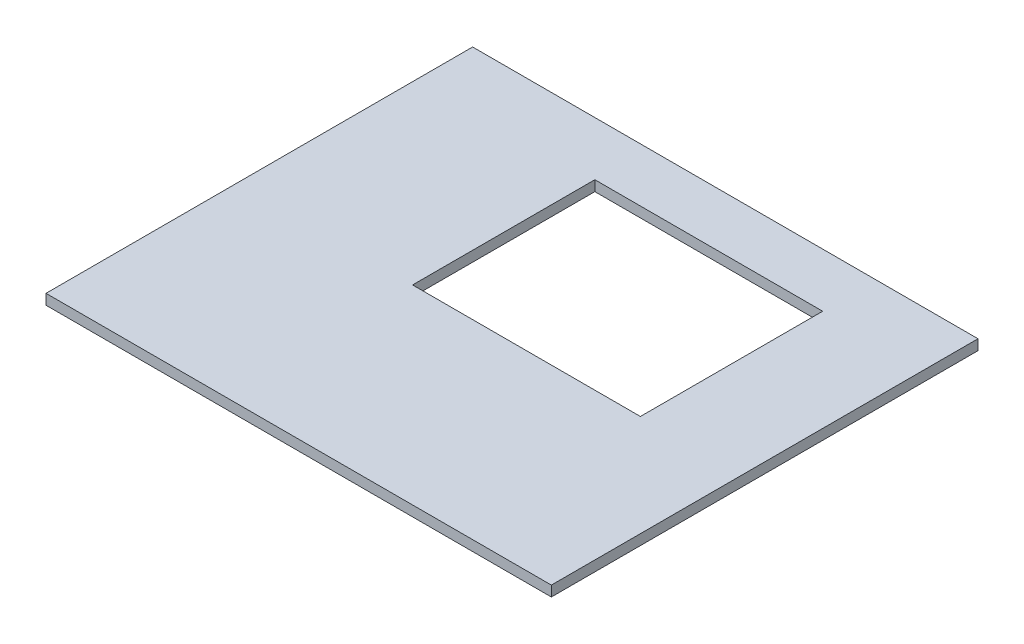
ISO-10303-21;
HEADER;
FILE_DESCRIPTION(('STEP AP214'),'2;1');
FILE_NAME('part.step','',(''),(''),'','','');
FILE_SCHEMA(('AUTOMOTIVE_DESIGN { 1 0 10303 214 1 1 1 1 }'));
ENDSEC;
DATA;
#1=APPLICATION_CONTEXT('core data for automotive mechanical design processes');
#2=APPLICATION_PROTOCOL_DEFINITION('international standard','automotive_design',2000,#1);
#3=PRODUCT_CONTEXT('',#1,'mechanical');
#4=PRODUCT('Part','Part','',(#3));
#5=PRODUCT_RELATED_PRODUCT_CATEGORY('part','',(#4));
#6=PRODUCT_DEFINITION_FORMATION('','',#4);
#7=PRODUCT_DEFINITION_CONTEXT('part definition',#1,'design');
#8=PRODUCT_DEFINITION('design','',#6,#7);
#9=PRODUCT_DEFINITION_SHAPE('','',#8);
#10=(LENGTH_UNIT() NAMED_UNIT(*) SI_UNIT(.MILLI.,.METRE.));
#11=(NAMED_UNIT(*) PLANE_ANGLE_UNIT() SI_UNIT($,.RADIAN.));
#12=(NAMED_UNIT(*) SI_UNIT($,.STERADIAN.) SOLID_ANGLE_UNIT());
#13=UNCERTAINTY_MEASURE_WITH_UNIT(LENGTH_MEASURE(1.E-05),#10,'distance_accuracy_value','');
#14=(GEOMETRIC_REPRESENTATION_CONTEXT(3) GLOBAL_UNCERTAINTY_ASSIGNED_CONTEXT((#13)) GLOBAL_UNIT_ASSIGNED_CONTEXT((#10,
#11,#12)) REPRESENTATION_CONTEXT('',''));
#15=CARTESIAN_POINT('',(0.,0.,0.));
#16=DIRECTION('',(0.,0.,1.));
#17=DIRECTION('',(1.,0.,0.));
#18=AXIS2_PLACEMENT_3D('',#15,#16,#17);
#19=CARTESIAN_POINT('',(-59.5,2.5,-51.5));
#20=DIRECTION('',(0.,0.,1.));
#21=DIRECTION('',(1.,0.,0.));
#22=AXIS2_PLACEMENT_3D('',#19,#20,#21);
#23=PLANE('',#22);
#24=DIRECTION('',(-1.,0.,0.));
#25=VECTOR('',#24,1.);
#26=CARTESIAN_POINT('',(-59.5,0.,-51.5));
#27=LINE('',#26,#25);
#28=CARTESIAN_POINT('',(61.,0.,-51.5));
#29=VERTEX_POINT('',#28);
#30=CARTESIAN_POINT('',(-61.,0.,-51.5));
#31=VERTEX_POINT('',#30);
#32=EDGE_CURVE('E110',#29,#31,#27,.T.);
#33=ORIENTED_EDGE('',*,*,#32,.T.);
#34=DIRECTION('',(0.,-1.,0.));
#35=VECTOR('',#34,1.);
#36=CARTESIAN_POINT('',(-61.,2.5,-51.5));
#37=LINE('',#36,#35);
#38=CARTESIAN_POINT('',(-61.,2.5,-51.5));
#39=VERTEX_POINT('',#38);
#40=EDGE_CURVE('E128',#39,#31,#37,.T.);
#41=ORIENTED_EDGE('',*,*,#40,.F.);
#42=DIRECTION('',(-1.,0.,0.));
#43=VECTOR('',#42,1.);
#44=CARTESIAN_POINT('',(-59.5,2.5,-51.5));
#45=LINE('',#44,#43);
#46=CARTESIAN_POINT('',(61.,2.5,-51.5));
#47=VERTEX_POINT('',#46);
#48=EDGE_CURVE('E109',#47,#39,#45,.T.);
#49=ORIENTED_EDGE('',*,*,#48,.F.);
#50=DIRECTION('',(0.,1.,0.));
#51=VECTOR('',#50,1.);
#52=CARTESIAN_POINT('',(61.,0.,-51.5));
#53=LINE('',#52,#51);
#54=EDGE_CURVE('E118',#29,#47,#53,.T.);
#55=ORIENTED_EDGE('',*,*,#54,.F.);
#56=EDGE_LOOP('',(#33,#41,#49,#55));
#57=FACE_BOUND('',#56,.T.);
#58=ADVANCED_FACE('F35',(#57),#23,.F.);
#59=CARTESIAN_POINT('',(-59.5,2.5,51.5));
#60=DIRECTION('',(0.,0.,-1.));
#61=DIRECTION('',(-1.,0.,0.));
#62=AXIS2_PLACEMENT_3D('',#59,#60,#61);
#63=PLANE('',#62);
#64=DIRECTION('',(1.,0.,0.));
#65=VECTOR('',#64,1.);
#66=CARTESIAN_POINT('',(-59.5,0.,51.5));
#67=LINE('',#66,#65);
#68=CARTESIAN_POINT('',(-61.,0.,51.5));
#69=VERTEX_POINT('',#68);
#70=CARTESIAN_POINT('',(61.,0.,51.5));
#71=VERTEX_POINT('',#70);
#72=EDGE_CURVE('E99',#69,#71,#67,.T.);
#73=ORIENTED_EDGE('',*,*,#72,.T.);
#74=DIRECTION('',(0.,-1.,0.));
#75=VECTOR('',#74,1.);
#76=CARTESIAN_POINT('',(61.,2.5,51.5));
#77=LINE('',#76,#75);
#78=CARTESIAN_POINT('',(61.,2.5,51.5));
#79=VERTEX_POINT('',#78);
#80=EDGE_CURVE('E103',#79,#71,#77,.T.);
#81=ORIENTED_EDGE('',*,*,#80,.F.);
#82=DIRECTION('',(1.,0.,0.));
#83=VECTOR('',#82,1.);
#84=CARTESIAN_POINT('',(-59.5,2.5,51.5));
#85=LINE('',#84,#83);
#86=CARTESIAN_POINT('',(-61.,2.5,51.5));
#87=VERTEX_POINT('',#86);
#88=EDGE_CURVE('E154',#87,#79,#85,.T.);
#89=ORIENTED_EDGE('',*,*,#88,.F.);
#90=DIRECTION('',(0.,1.,0.));
#91=VECTOR('',#90,1.);
#92=CARTESIAN_POINT('',(-61.,0.,51.5));
#93=LINE('',#92,#91);
#94=EDGE_CURVE('E105',#69,#87,#93,.T.);
#95=ORIENTED_EDGE('',*,*,#94,.F.);
#96=EDGE_LOOP('',(#73,#81,#89,#95));
#97=FACE_BOUND('',#96,.T.);
#98=ADVANCED_FACE('F101',(#97),#63,.F.);
#99=CARTESIAN_POINT('',(0.,2.5,0.));
#100=DIRECTION('',(0.,-1.,0.));
#101=DIRECTION('',(0.,0.,-1.));
#102=AXIS2_PLACEMENT_3D('',#99,#100,#101);
#103=PLANE('',#102);
#104=DIRECTION('',(-1.,0.,0.));
#105=VECTOR('',#104,1.);
#106=CARTESIAN_POINT('',(-18.5,2.5,-38.5));
#107=LINE('',#106,#105);
#108=CARTESIAN_POINT('',(36.5,2.5,-38.5));
#109=VERTEX_POINT('',#108);
#110=CARTESIAN_POINT('',(-18.5,2.5,-38.5));
#111=VERTEX_POINT('',#110);
#112=EDGE_CURVE('E138',#109,#111,#107,.T.);
#113=ORIENTED_EDGE('',*,*,#112,.F.);
#114=DIRECTION('',(0.,0.,-1.));
#115=VECTOR('',#114,1.);
#116=CARTESIAN_POINT('',(36.5,2.5,5.50000000000001));
#117=LINE('',#116,#115);
#118=CARTESIAN_POINT('',(36.5,2.5,5.50000000000001));
#119=VERTEX_POINT('',#118);
#120=EDGE_CURVE('E49',#119,#109,#117,.T.);
#121=ORIENTED_EDGE('',*,*,#120,.F.);
#122=DIRECTION('',(1.,0.,0.));
#123=VECTOR('',#122,1.);
#124=CARTESIAN_POINT('',(-18.5,2.5,5.50000000000001));
#125=LINE('',#124,#123);
#126=CARTESIAN_POINT('',(-18.5,2.5,5.50000000000001));
#127=VERTEX_POINT('',#126);
#128=EDGE_CURVE('E143',#127,#119,#125,.T.);
#129=ORIENTED_EDGE('',*,*,#128,.F.);
#130=DIRECTION('',(0.,0.,1.));
#131=VECTOR('',#130,1.);
#132=CARTESIAN_POINT('',(-18.5,2.5,5.50000000000001));
#133=LINE('',#132,#131);
#134=EDGE_CURVE('E140',#111,#127,#133,.T.);
#135=ORIENTED_EDGE('',*,*,#134,.F.);
#136=EDGE_LOOP('',(#113,#121,#129,#135));
#137=FACE_BOUND('',#136,.T.);
#138=ORIENTED_EDGE('',*,*,#88,.T.);
#139=DIRECTION('',(0.,0.,1.));
#140=VECTOR('',#139,1.);
#141=CARTESIAN_POINT('',(61.,2.5,-51.5));
#142=LINE('',#141,#140);
#143=EDGE_CURVE('E123',#47,#79,#142,.T.);
#144=ORIENTED_EDGE('',*,*,#143,.F.);
#145=ORIENTED_EDGE('',*,*,#48,.T.);
#146=DIRECTION('',(0.,0.,-1.));
#147=VECTOR('',#146,1.);
#148=CARTESIAN_POINT('',(-61.,2.5,51.5));
#149=LINE('',#148,#147);
#150=EDGE_CURVE('E134',#87,#39,#149,.T.);
#151=ORIENTED_EDGE('',*,*,#150,.F.);
#152=EDGE_LOOP('',(#138,#144,#145,#151));
#153=FACE_BOUND('',#152,.T.);
#154=ADVANCED_FACE('F177',(#137,#153),#103,.F.);
#155=CARTESIAN_POINT('',(0.,0.,0.));
#156=DIRECTION('',(0.,-1.,0.));
#157=DIRECTION('',(0.,0.,-1.));
#158=AXIS2_PLACEMENT_3D('',#155,#156,#157);
#159=PLANE('',#158);
#160=DIRECTION('',(0.,0.,1.));
#161=VECTOR('',#160,1.);
#162=CARTESIAN_POINT('',(36.5,0.,0.));
#163=LINE('',#162,#161);
#164=CARTESIAN_POINT('',(36.5,0.,-38.5));
#165=VERTEX_POINT('',#164);
#166=CARTESIAN_POINT('',(36.5,0.,5.50000000000001));
#167=VERTEX_POINT('',#166);
#168=EDGE_CURVE('E11',#165,#167,#163,.T.);
#169=ORIENTED_EDGE('',*,*,#168,.F.);
#170=DIRECTION('',(1.,0.,0.));
#171=VECTOR('',#170,1.);
#172=CARTESIAN_POINT('',(0.,0.,-38.5));
#173=LINE('',#172,#171);
#174=CARTESIAN_POINT('',(-18.5,0.,-38.5));
#175=VERTEX_POINT('',#174);
#176=EDGE_CURVE('E156',#175,#165,#173,.T.);
#177=ORIENTED_EDGE('',*,*,#176,.F.);
#178=DIRECTION('',(0.,0.,-1.));
#179=VECTOR('',#178,1.);
#180=CARTESIAN_POINT('',(-18.5,0.,0.));
#181=LINE('',#180,#179);
#182=CARTESIAN_POINT('',(-18.5,0.,5.50000000000001));
#183=VERTEX_POINT('',#182);
#184=EDGE_CURVE('E159',#183,#175,#181,.T.);
#185=ORIENTED_EDGE('',*,*,#184,.F.);
#186=DIRECTION('',(-1.,0.,0.));
#187=VECTOR('',#186,1.);
#188=CARTESIAN_POINT('',(0.,0.,5.50000000000001));
#189=LINE('',#188,#187);
#190=EDGE_CURVE('E42',#167,#183,#189,.T.);
#191=ORIENTED_EDGE('',*,*,#190,.F.);
#192=EDGE_LOOP('',(#169,#177,#185,#191));
#193=FACE_BOUND('',#192,.T.);
#194=ORIENTED_EDGE('',*,*,#32,.F.);
#195=DIRECTION('',(0.,0.,-1.));
#196=VECTOR('',#195,1.);
#197=CARTESIAN_POINT('',(61.,0.,51.5));
#198=LINE('',#197,#196);
#199=EDGE_CURVE('E113',#71,#29,#198,.T.);
#200=ORIENTED_EDGE('',*,*,#199,.F.);
#201=ORIENTED_EDGE('',*,*,#72,.F.);
#202=DIRECTION('',(0.,0.,1.));
#203=VECTOR('',#202,1.);
#204=CARTESIAN_POINT('',(-61.,0.,-51.5));
#205=LINE('',#204,#203);
#206=EDGE_CURVE('E131',#31,#69,#205,.T.);
#207=ORIENTED_EDGE('',*,*,#206,.F.);
#208=EDGE_LOOP('',(#194,#200,#201,#207));
#209=FACE_BOUND('',#208,.T.);
#210=ADVANCED_FACE('F114',(#193,#209),#159,.T.);
#211=CARTESIAN_POINT('',(36.5,-7.5,5.50000000000001));
#212=DIRECTION('',(1.,0.,0.));
#213=DIRECTION('',(0.,0.,-1.));
#214=AXIS2_PLACEMENT_3D('',#211,#212,#213);
#215=PLANE('',#214);
#216=ORIENTED_EDGE('',*,*,#168,.T.);
#217=DIRECTION('',(0.,1.,0.));
#218=VECTOR('',#217,1.);
#219=CARTESIAN_POINT('',(36.5,-7.5,5.50000000000001));
#220=LINE('',#219,#218);
#221=EDGE_CURVE('E147',#167,#119,#220,.T.);
#222=ORIENTED_EDGE('',*,*,#221,.T.);
#223=ORIENTED_EDGE('',*,*,#120,.T.);
#224=DIRECTION('',(0.,1.,0.));
#225=VECTOR('',#224,1.);
#226=CARTESIAN_POINT('',(36.5,-7.5,-38.5));
#227=LINE('',#226,#225);
#228=EDGE_CURVE('E146',#165,#109,#227,.T.);
#229=ORIENTED_EDGE('',*,*,#228,.F.);
#230=EDGE_LOOP('',(#216,#222,#223,#229));
#231=FACE_BOUND('',#230,.T.);
#232=ADVANCED_FACE('F175',(#231),#215,.F.);
#233=CARTESIAN_POINT('',(-18.5,-7.5,5.50000000000001));
#234=DIRECTION('',(0.,0.,1.));
#235=DIRECTION('',(1.,0.,0.));
#236=AXIS2_PLACEMENT_3D('',#233,#234,#235);
#237=PLANE('',#236);
#238=ORIENTED_EDGE('',*,*,#190,.T.);
#239=DIRECTION('',(0.,1.,0.));
#240=VECTOR('',#239,1.);
#241=CARTESIAN_POINT('',(-18.5,-7.5,5.50000000000001));
#242=LINE('',#241,#240);
#243=EDGE_CURVE('E149',#183,#127,#242,.T.);
#244=ORIENTED_EDGE('',*,*,#243,.T.);
#245=ORIENTED_EDGE('',*,*,#128,.T.);
#246=ORIENTED_EDGE('',*,*,#221,.F.);
#247=EDGE_LOOP('',(#238,#244,#245,#246));
#248=FACE_BOUND('',#247,.T.);
#249=ADVANCED_FACE('F164',(#248),#237,.F.);
#250=CARTESIAN_POINT('',(-18.5,-7.5,5.50000000000001));
#251=DIRECTION('',(-1.,0.,0.));
#252=DIRECTION('',(0.,0.,1.));
#253=AXIS2_PLACEMENT_3D('',#250,#251,#252);
#254=PLANE('',#253);
#255=ORIENTED_EDGE('',*,*,#184,.T.);
#256=DIRECTION('',(0.,1.,0.));
#257=VECTOR('',#256,1.);
#258=CARTESIAN_POINT('',(-18.5,-7.5,-38.5));
#259=LINE('',#258,#257);
#260=EDGE_CURVE('E57',#175,#111,#259,.T.);
#261=ORIENTED_EDGE('',*,*,#260,.T.);
#262=ORIENTED_EDGE('',*,*,#134,.T.);
#263=ORIENTED_EDGE('',*,*,#243,.F.);
#264=EDGE_LOOP('',(#255,#261,#262,#263));
#265=FACE_BOUND('',#264,.T.);
#266=ADVANCED_FACE('F169',(#265),#254,.F.);
#267=CARTESIAN_POINT('',(-18.5,-7.5,-38.5));
#268=DIRECTION('',(0.,0.,-1.));
#269=DIRECTION('',(-1.,0.,0.));
#270=AXIS2_PLACEMENT_3D('',#267,#268,#269);
#271=PLANE('',#270);
#272=ORIENTED_EDGE('',*,*,#176,.T.);
#273=ORIENTED_EDGE('',*,*,#228,.T.);
#274=ORIENTED_EDGE('',*,*,#112,.T.);
#275=ORIENTED_EDGE('',*,*,#260,.F.);
#276=EDGE_LOOP('',(#272,#273,#274,#275));
#277=FACE_BOUND('',#276,.T.);
#278=ADVANCED_FACE('F173',(#277),#271,.F.);
#279=CARTESIAN_POINT('',(-61.,0.,0.));
#280=DIRECTION('',(-1.,0.,0.));
#281=DIRECTION('',(0.,0.,1.));
#282=AXIS2_PLACEMENT_3D('',#279,#280,#281);
#283=PLANE('',#282);
#284=ORIENTED_EDGE('',*,*,#40,.T.);
#285=ORIENTED_EDGE('',*,*,#206,.T.);
#286=ORIENTED_EDGE('',*,*,#94,.T.);
#287=ORIENTED_EDGE('',*,*,#150,.T.);
#288=EDGE_LOOP('',(#284,#285,#286,#287));
#289=FACE_BOUND('',#288,.T.);
#290=ADVANCED_FACE('F183',(#289),#283,.T.);
#291=CARTESIAN_POINT('',(61.,0.,0.));
#292=DIRECTION('',(1.,0.,0.));
#293=DIRECTION('',(0.,0.,-1.));
#294=AXIS2_PLACEMENT_3D('',#291,#292,#293);
#295=PLANE('',#294);
#296=ORIENTED_EDGE('',*,*,#80,.T.);
#297=ORIENTED_EDGE('',*,*,#199,.T.);
#298=ORIENTED_EDGE('',*,*,#54,.T.);
#299=ORIENTED_EDGE('',*,*,#143,.T.);
#300=EDGE_LOOP('',(#296,#297,#298,#299));
#301=FACE_BOUND('',#300,.T.);
#302=ADVANCED_FACE('F121',(#301),#295,.T.);
#303=CLOSED_SHELL('',(#58,#98,#154,#210,#232,#249,#266,#278,#290,#302));
#304=MANIFOLD_SOLID_BREP('B2',#303);
#305=ADVANCED_BREP_SHAPE_REPRESENTATION('',(#18,#304),#14);
#306=SHAPE_DEFINITION_REPRESENTATION(#9,#305);
ENDSEC;
END-ISO-10303-21;
